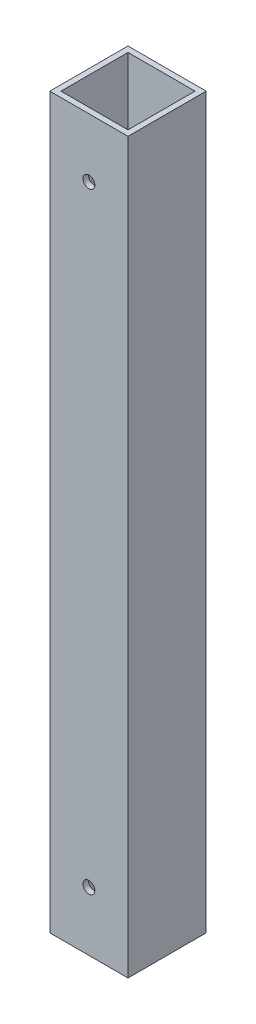
ISO-10303-21;
HEADER;
FILE_DESCRIPTION(('STEP AP214'),'2;1');
FILE_NAME('part.step','',(''),(''),'','','');
FILE_SCHEMA(('AUTOMOTIVE_DESIGN { 1 0 10303 214 1 1 1 1 }'));
ENDSEC;
DATA;
#1=APPLICATION_CONTEXT('core data for automotive mechanical design processes');
#2=APPLICATION_PROTOCOL_DEFINITION('international standard','automotive_design',2000,#1);
#3=PRODUCT_CONTEXT('',#1,'mechanical');
#4=PRODUCT('Part','Part','',(#3));
#5=PRODUCT_RELATED_PRODUCT_CATEGORY('part','',(#4));
#6=PRODUCT_DEFINITION_FORMATION('','',#4);
#7=PRODUCT_DEFINITION_CONTEXT('part definition',#1,'design');
#8=PRODUCT_DEFINITION('design','',#6,#7);
#9=PRODUCT_DEFINITION_SHAPE('','',#8);
#10=(LENGTH_UNIT() NAMED_UNIT(*) SI_UNIT(.MILLI.,.METRE.));
#11=(NAMED_UNIT(*) PLANE_ANGLE_UNIT() SI_UNIT($,.RADIAN.));
#12=(NAMED_UNIT(*) SI_UNIT($,.STERADIAN.) SOLID_ANGLE_UNIT());
#13=UNCERTAINTY_MEASURE_WITH_UNIT(LENGTH_MEASURE(1.E-05),#10,'distance_accuracy_value','');
#14=(GEOMETRIC_REPRESENTATION_CONTEXT(3) GLOBAL_UNCERTAINTY_ASSIGNED_CONTEXT((#13)) GLOBAL_UNIT_ASSIGNED_CONTEXT((#10,
#11,#12)) REPRESENTATION_CONTEXT('',''));
#15=CARTESIAN_POINT('',(0.,0.,0.));
#16=DIRECTION('',(0.,0.,1.));
#17=DIRECTION('',(1.,0.,0.));
#18=AXIS2_PLACEMENT_3D('',#15,#16,#17);
#19=CARTESIAN_POINT('',(22.2250000000001,-207.16875,22.225));
#20=DIRECTION('',(1.,0.,0.));
#21=DIRECTION('',(0.,0.,-1.));
#22=AXIS2_PLACEMENT_3D('',#19,#20,#21);
#23=PLANE('',#22);
#24=DIRECTION('',(0.,1.,0.));
#25=VECTOR('',#24,1.);
#26=CARTESIAN_POINT('',(22.2250000000001,-207.16875,-22.225));
#27=LINE('',#26,#25);
#28=CARTESIAN_POINT('',(22.2250000000001,-207.16875,-22.225));
#29=VERTEX_POINT('',#28);
#30=CARTESIAN_POINT('',(22.2250000000001,207.16875,-22.225));
#31=VERTEX_POINT('',#30);
#32=EDGE_CURVE('E191',#29,#31,#27,.T.);
#33=ORIENTED_EDGE('',*,*,#32,.T.);
#34=DIRECTION('',(0.,0.,-1.));
#35=VECTOR('',#34,1.);
#36=CARTESIAN_POINT('',(22.2250000000001,207.16875,22.225));
#37=LINE('',#36,#35);
#38=CARTESIAN_POINT('',(22.2250000000001,207.16875,22.225));
#39=VERTEX_POINT('',#38);
#40=EDGE_CURVE('E144',#39,#31,#37,.T.);
#41=ORIENTED_EDGE('',*,*,#40,.F.);
#42=DIRECTION('',(0.,1.,0.));
#43=VECTOR('',#42,1.);
#44=CARTESIAN_POINT('',(22.2250000000001,-207.16875,22.225));
#45=LINE('',#44,#43);
#46=CARTESIAN_POINT('',(22.2250000000001,-207.16875,22.225));
#47=VERTEX_POINT('',#46);
#48=EDGE_CURVE('E11',#47,#39,#45,.T.);
#49=ORIENTED_EDGE('',*,*,#48,.F.);
#50=DIRECTION('',(0.,0.,-1.));
#51=VECTOR('',#50,1.);
#52=CARTESIAN_POINT('',(22.2250000000001,-207.16875,22.225));
#53=LINE('',#52,#51);
#54=EDGE_CURVE('E172',#47,#29,#53,.T.);
#55=ORIENTED_EDGE('',*,*,#54,.T.);
#56=EDGE_LOOP('',(#33,#41,#49,#55));
#57=FACE_BOUND('',#56,.T.);
#58=ADVANCED_FACE('F40',(#57),#23,.T.);
#59=CARTESIAN_POINT('',(-22.2249999999999,-207.16875,22.225));
#60=DIRECTION('',(0.,0.,1.));
#61=DIRECTION('',(1.,0.,0.));
#62=AXIS2_PLACEMENT_3D('',#59,#60,#61);
#63=PLANE('',#62);
#64=CARTESIAN_POINT('',(0.,173.609,22.225));
#65=DIRECTION('',(0.,0.,1.));
#66=DIRECTION('',(1.,0.,0.));
#67=AXIS2_PLACEMENT_3D('',#64,#65,#66);
#68=CIRCLE('',#67,3.37350099999999);
#69=CARTESIAN_POINT('',(3.37350099999999,173.609,22.225));
#70=VERTEX_POINT('',#69);
#71=EDGE_CURVE('E227',#70,#70,#68,.T.);
#72=ORIENTED_EDGE('',*,*,#71,.F.);
#73=EDGE_LOOP('',(#72));
#74=FACE_BOUND('',#73,.T.);
#75=CARTESIAN_POINT('',(0.,-173.609,22.225));
#76=DIRECTION('',(0.,0.,1.));
#77=DIRECTION('',(1.,0.,0.));
#78=AXIS2_PLACEMENT_3D('',#75,#76,#77);
#79=CIRCLE('',#78,3.37350099999999);
#80=CARTESIAN_POINT('',(3.37350099999999,-173.609,22.225));
#81=VERTEX_POINT('',#80);
#82=EDGE_CURVE('E210',#81,#81,#79,.T.);
#83=ORIENTED_EDGE('',*,*,#82,.F.);
#84=EDGE_LOOP('',(#83));
#85=FACE_BOUND('',#84,.T.);
#86=ORIENTED_EDGE('',*,*,#48,.T.);
#87=DIRECTION('',(1.,0.,0.));
#88=VECTOR('',#87,1.);
#89=CARTESIAN_POINT('',(-22.2249999999999,207.16875,22.225));
#90=LINE('',#89,#88);
#91=CARTESIAN_POINT('',(-22.2249999999999,207.16875,22.225));
#92=VERTEX_POINT('',#91);
#93=EDGE_CURVE('E156',#92,#39,#90,.T.);
#94=ORIENTED_EDGE('',*,*,#93,.F.);
#95=DIRECTION('',(0.,1.,0.));
#96=VECTOR('',#95,1.);
#97=CARTESIAN_POINT('',(-22.2249999999999,-207.16875,22.225));
#98=LINE('',#97,#96);
#99=CARTESIAN_POINT('',(-22.2249999999999,-207.16875,22.225));
#100=VERTEX_POINT('',#99);
#101=EDGE_CURVE('E49',#100,#92,#98,.T.);
#102=ORIENTED_EDGE('',*,*,#101,.F.);
#103=DIRECTION('',(1.,0.,0.));
#104=VECTOR('',#103,1.);
#105=CARTESIAN_POINT('',(-22.2249999999999,-207.16875,22.225));
#106=LINE('',#105,#104);
#107=EDGE_CURVE('E188',#100,#47,#106,.T.);
#108=ORIENTED_EDGE('',*,*,#107,.T.);
#109=EDGE_LOOP('',(#86,#94,#102,#108));
#110=FACE_BOUND('',#109,.T.);
#111=ADVANCED_FACE('F236',(#74,#85,#110),#63,.T.);
#112=CARTESIAN_POINT('',(-22.2249999999999,-207.16875,22.225));
#113=DIRECTION('',(-1.,0.,0.));
#114=DIRECTION('',(0.,0.,1.));
#115=AXIS2_PLACEMENT_3D('',#112,#113,#114);
#116=PLANE('',#115);
#117=ORIENTED_EDGE('',*,*,#101,.T.);
#118=DIRECTION('',(0.,0.,1.));
#119=VECTOR('',#118,1.);
#120=CARTESIAN_POINT('',(-22.2249999999999,207.16875,22.225));
#121=LINE('',#120,#119);
#122=CARTESIAN_POINT('',(-22.2249999999999,207.16875,-22.225));
#123=VERTEX_POINT('',#122);
#124=EDGE_CURVE('E152',#123,#92,#121,.T.);
#125=ORIENTED_EDGE('',*,*,#124,.F.);
#126=DIRECTION('',(0.,1.,0.));
#127=VECTOR('',#126,1.);
#128=CARTESIAN_POINT('',(-22.2249999999999,-207.16875,-22.225));
#129=LINE('',#128,#127);
#130=CARTESIAN_POINT('',(-22.2249999999999,-207.16875,-22.225));
#131=VERTEX_POINT('',#130);
#132=EDGE_CURVE('E195',#131,#123,#129,.T.);
#133=ORIENTED_EDGE('',*,*,#132,.F.);
#134=DIRECTION('',(0.,0.,1.));
#135=VECTOR('',#134,1.);
#136=CARTESIAN_POINT('',(-22.2249999999999,-207.16875,22.225));
#137=LINE('',#136,#135);
#138=EDGE_CURVE('E184',#131,#100,#137,.T.);
#139=ORIENTED_EDGE('',*,*,#138,.T.);
#140=EDGE_LOOP('',(#117,#125,#133,#139));
#141=FACE_BOUND('',#140,.T.);
#142=ADVANCED_FACE('F239',(#141),#116,.T.);
#143=CARTESIAN_POINT('',(-22.2249999999999,-207.16875,-22.225));
#144=DIRECTION('',(0.,0.,-1.));
#145=DIRECTION('',(-1.,0.,0.));
#146=AXIS2_PLACEMENT_3D('',#143,#144,#145);
#147=PLANE('',#146);
#148=CARTESIAN_POINT('',(0.,173.609,-22.225));
#149=DIRECTION('',(0.,0.,1.));
#150=DIRECTION('',(1.,0.,0.));
#151=AXIS2_PLACEMENT_3D('',#148,#149,#150);
#152=CIRCLE('',#151,3.37350099999999);
#153=CARTESIAN_POINT('',(3.37350099999999,173.609,-22.225));
#154=VERTEX_POINT('',#153);
#155=EDGE_CURVE('E223',#154,#154,#152,.T.);
#156=ORIENTED_EDGE('',*,*,#155,.T.);
#157=EDGE_LOOP('',(#156));
#158=FACE_BOUND('',#157,.T.);
#159=CARTESIAN_POINT('',(0.,-173.609,-22.225));
#160=DIRECTION('',(0.,0.,1.));
#161=DIRECTION('',(1.,0.,0.));
#162=AXIS2_PLACEMENT_3D('',#159,#160,#161);
#163=CIRCLE('',#162,3.37350099999999);
#164=CARTESIAN_POINT('',(3.37350099999999,-173.609,-22.225));
#165=VERTEX_POINT('',#164);
#166=EDGE_CURVE('E202',#165,#165,#163,.T.);
#167=ORIENTED_EDGE('',*,*,#166,.T.);
#168=EDGE_LOOP('',(#167));
#169=FACE_BOUND('',#168,.T.);
#170=ORIENTED_EDGE('',*,*,#132,.T.);
#171=DIRECTION('',(-1.,0.,0.));
#172=VECTOR('',#171,1.);
#173=CARTESIAN_POINT('',(-22.2249999999999,207.16875,-22.225));
#174=LINE('',#173,#172);
#175=EDGE_CURVE('E148',#31,#123,#174,.T.);
#176=ORIENTED_EDGE('',*,*,#175,.F.);
#177=ORIENTED_EDGE('',*,*,#32,.F.);
#178=DIRECTION('',(-1.,0.,0.));
#179=VECTOR('',#178,1.);
#180=CARTESIAN_POINT('',(-22.2249999999999,-207.16875,-22.225));
#181=LINE('',#180,#179);
#182=EDGE_CURVE('E180',#29,#131,#181,.T.);
#183=ORIENTED_EDGE('',*,*,#182,.T.);
#184=EDGE_LOOP('',(#170,#176,#177,#183));
#185=FACE_BOUND('',#184,.T.);
#186=ADVANCED_FACE('F250',(#158,#169,#185),#147,.T.);
#187=CARTESIAN_POINT('',(0.,-207.16875,0.));
#188=DIRECTION('',(0.,-1.,0.));
#189=DIRECTION('',(0.,0.,-1.));
#190=AXIS2_PLACEMENT_3D('',#187,#188,#189);
#191=PLANE('',#190);
#192=DIRECTION('',(0.,0.,-1.));
#193=VECTOR('',#192,1.);
#194=CARTESIAN_POINT('',(19.05,-207.16875,19.05));
#195=LINE('',#194,#193);
#196=CARTESIAN_POINT('',(19.05,-207.16875,19.05));
#197=VERTEX_POINT('',#196);
#198=CARTESIAN_POINT('',(19.05,-207.16875,-19.05));
#199=VERTEX_POINT('',#198);
#200=EDGE_CURVE('E160',#197,#199,#195,.T.);
#201=ORIENTED_EDGE('',*,*,#200,.T.);
#202=DIRECTION('',(-1.,0.,0.));
#203=VECTOR('',#202,1.);
#204=CARTESIAN_POINT('',(-19.05,-207.16875,-19.05));
#205=LINE('',#204,#203);
#206=CARTESIAN_POINT('',(-19.05,-207.16875,-19.05));
#207=VERTEX_POINT('',#206);
#208=EDGE_CURVE('E113',#199,#207,#205,.T.);
#209=ORIENTED_EDGE('',*,*,#208,.T.);
#210=DIRECTION('',(0.,0.,1.));
#211=VECTOR('',#210,1.);
#212=CARTESIAN_POINT('',(-19.05,-207.16875,19.05));
#213=LINE('',#212,#211);
#214=CARTESIAN_POINT('',(-19.05,-207.16875,19.05));
#215=VERTEX_POINT('',#214);
#216=EDGE_CURVE('E57',#207,#215,#213,.T.);
#217=ORIENTED_EDGE('',*,*,#216,.T.);
#218=DIRECTION('',(1.,0.,0.));
#219=VECTOR('',#218,1.);
#220=CARTESIAN_POINT('',(-19.05,-207.16875,19.05));
#221=LINE('',#220,#219);
#222=EDGE_CURVE('E119',#215,#197,#221,.T.);
#223=ORIENTED_EDGE('',*,*,#222,.T.);
#224=EDGE_LOOP('',(#201,#209,#217,#223));
#225=FACE_BOUND('',#224,.T.);
#226=ORIENTED_EDGE('',*,*,#54,.F.);
#227=ORIENTED_EDGE('',*,*,#107,.F.);
#228=ORIENTED_EDGE('',*,*,#138,.F.);
#229=ORIENTED_EDGE('',*,*,#182,.F.);
#230=EDGE_LOOP('',(#226,#227,#228,#229));
#231=FACE_BOUND('',#230,.T.);
#232=ADVANCED_FACE('F254',(#225,#231),#191,.T.);
#233=CARTESIAN_POINT('',(19.05,-207.16875,19.05));
#234=DIRECTION('',(1.,0.,0.));
#235=DIRECTION('',(0.,0.,-1.));
#236=AXIS2_PLACEMENT_3D('',#233,#234,#235);
#237=PLANE('',#236);
#238=DIRECTION('',(0.,1.,0.));
#239=VECTOR('',#238,1.);
#240=CARTESIAN_POINT('',(19.05,-207.16875,19.05));
#241=LINE('',#240,#239);
#242=CARTESIAN_POINT('',(19.05,207.16875,19.05));
#243=VERTEX_POINT('',#242);
#244=EDGE_CURVE('E124',#197,#243,#241,.T.);
#245=ORIENTED_EDGE('',*,*,#244,.T.);
#246=DIRECTION('',(0.,0.,-1.));
#247=VECTOR('',#246,1.);
#248=CARTESIAN_POINT('',(19.05,207.16875,19.05));
#249=LINE('',#248,#247);
#250=CARTESIAN_POINT('',(19.05,207.16875,-19.05));
#251=VERTEX_POINT('',#250);
#252=EDGE_CURVE('E122',#243,#251,#249,.T.);
#253=ORIENTED_EDGE('',*,*,#252,.T.);
#254=DIRECTION('',(0.,1.,0.));
#255=VECTOR('',#254,1.);
#256=CARTESIAN_POINT('',(19.05,-207.16875,-19.05));
#257=LINE('',#256,#255);
#258=EDGE_CURVE('E106',#199,#251,#257,.T.);
#259=ORIENTED_EDGE('',*,*,#258,.F.);
#260=ORIENTED_EDGE('',*,*,#200,.F.);
#261=EDGE_LOOP('',(#245,#253,#259,#260));
#262=FACE_BOUND('',#261,.T.);
#263=ADVANCED_FACE('F123',(#262),#237,.F.);
#264=CARTESIAN_POINT('',(-19.05,-207.16875,19.05));
#265=DIRECTION('',(0.,0.,1.));
#266=DIRECTION('',(1.,0.,0.));
#267=AXIS2_PLACEMENT_3D('',#264,#265,#266);
#268=PLANE('',#267);
#269=CARTESIAN_POINT('',(0.,173.609,19.05));
#270=DIRECTION('',(0.,0.,1.));
#271=DIRECTION('',(1.,0.,0.));
#272=AXIS2_PLACEMENT_3D('',#269,#270,#271);
#273=CIRCLE('',#272,3.37350099999999);
#274=CARTESIAN_POINT('',(3.37350099999999,173.609,19.05));
#275=VERTEX_POINT('',#274);
#276=EDGE_CURVE('E217',#275,#275,#273,.T.);
#277=ORIENTED_EDGE('',*,*,#276,.T.);
#278=EDGE_LOOP('',(#277));
#279=FACE_BOUND('',#278,.T.);
#280=CARTESIAN_POINT('',(0.,-173.609,19.05));
#281=DIRECTION('',(0.,0.,1.));
#282=DIRECTION('',(1.,0.,0.));
#283=AXIS2_PLACEMENT_3D('',#280,#281,#282);
#284=CIRCLE('',#283,3.37350099999999);
#285=CARTESIAN_POINT('',(3.37350099999999,-173.609,19.05));
#286=VERTEX_POINT('',#285);
#287=EDGE_CURVE('E129',#286,#286,#284,.T.);
#288=ORIENTED_EDGE('',*,*,#287,.T.);
#289=EDGE_LOOP('',(#288));
#290=FACE_BOUND('',#289,.T.);
#291=DIRECTION('',(0.,1.,0.));
#292=VECTOR('',#291,1.);
#293=CARTESIAN_POINT('',(-19.05,-207.16875,19.05));
#294=LINE('',#293,#292);
#295=CARTESIAN_POINT('',(-19.05,207.16875,19.05));
#296=VERTEX_POINT('',#295);
#297=EDGE_CURVE('E173',#215,#296,#294,.T.);
#298=ORIENTED_EDGE('',*,*,#297,.T.);
#299=DIRECTION('',(1.,0.,0.));
#300=VECTOR('',#299,1.);
#301=CARTESIAN_POINT('',(-19.05,207.16875,19.05));
#302=LINE('',#301,#300);
#303=EDGE_CURVE('E138',#296,#243,#302,.T.);
#304=ORIENTED_EDGE('',*,*,#303,.T.);
#305=ORIENTED_EDGE('',*,*,#244,.F.);
#306=ORIENTED_EDGE('',*,*,#222,.F.);
#307=EDGE_LOOP('',(#298,#304,#305,#306));
#308=FACE_BOUND('',#307,.T.);
#309=ADVANCED_FACE('F262',(#279,#290,#308),#268,.F.);
#310=CARTESIAN_POINT('',(-19.05,-207.16875,19.05));
#311=DIRECTION('',(-1.,0.,0.));
#312=DIRECTION('',(0.,0.,1.));
#313=AXIS2_PLACEMENT_3D('',#310,#311,#312);
#314=PLANE('',#313);
#315=DIRECTION('',(0.,1.,0.));
#316=VECTOR('',#315,1.);
#317=CARTESIAN_POINT('',(-19.05,-207.16875,-19.05));
#318=LINE('',#317,#316);
#319=CARTESIAN_POINT('',(-19.05,207.16875,-19.05));
#320=VERTEX_POINT('',#319);
#321=EDGE_CURVE('E118',#207,#320,#318,.T.);
#322=ORIENTED_EDGE('',*,*,#321,.T.);
#323=DIRECTION('',(0.,0.,1.));
#324=VECTOR('',#323,1.);
#325=CARTESIAN_POINT('',(-19.05,207.16875,19.05));
#326=LINE('',#325,#324);
#327=EDGE_CURVE('E133',#320,#296,#326,.T.);
#328=ORIENTED_EDGE('',*,*,#327,.T.);
#329=ORIENTED_EDGE('',*,*,#297,.F.);
#330=ORIENTED_EDGE('',*,*,#216,.F.);
#331=EDGE_LOOP('',(#322,#328,#329,#330));
#332=FACE_BOUND('',#331,.T.);
#333=ADVANCED_FACE('F301',(#332),#314,.F.);
#334=CARTESIAN_POINT('',(-19.05,-207.16875,-19.05));
#335=DIRECTION('',(0.,0.,-1.));
#336=DIRECTION('',(-1.,0.,0.));
#337=AXIS2_PLACEMENT_3D('',#334,#335,#336);
#338=PLANE('',#337);
#339=CARTESIAN_POINT('',(0.,173.609,-19.05));
#340=DIRECTION('',(0.,0.,-1.));
#341=DIRECTION('',(-1.,0.,0.));
#342=AXIS2_PLACEMENT_3D('',#339,#340,#341);
#343=CIRCLE('',#342,3.37350099999999);
#344=CARTESIAN_POINT('',(-3.37350099999999,173.609,-19.05));
#345=VERTEX_POINT('',#344);
#346=EDGE_CURVE('E43',#345,#345,#343,.T.);
#347=ORIENTED_EDGE('',*,*,#346,.T.);
#348=EDGE_LOOP('',(#347));
#349=FACE_BOUND('',#348,.T.);
#350=CARTESIAN_POINT('',(0.,-173.609,-19.05));
#351=DIRECTION('',(0.,0.,-1.));
#352=DIRECTION('',(-1.,0.,0.));
#353=AXIS2_PLACEMENT_3D('',#350,#351,#352);
#354=CIRCLE('',#353,3.37350099999999);
#355=CARTESIAN_POINT('',(-3.37350099999999,-173.609,-19.05));
#356=VERTEX_POINT('',#355);
#357=EDGE_CURVE('E199',#356,#356,#354,.T.);
#358=ORIENTED_EDGE('',*,*,#357,.T.);
#359=EDGE_LOOP('',(#358));
#360=FACE_BOUND('',#359,.T.);
#361=ORIENTED_EDGE('',*,*,#258,.T.);
#362=DIRECTION('',(-1.,0.,0.));
#363=VECTOR('',#362,1.);
#364=CARTESIAN_POINT('',(-19.05,207.16875,-19.05));
#365=LINE('',#364,#363);
#366=EDGE_CURVE('E110',#251,#320,#365,.T.);
#367=ORIENTED_EDGE('',*,*,#366,.T.);
#368=ORIENTED_EDGE('',*,*,#321,.F.);
#369=ORIENTED_EDGE('',*,*,#208,.F.);
#370=EDGE_LOOP('',(#361,#367,#368,#369));
#371=FACE_BOUND('',#370,.T.);
#372=ADVANCED_FACE('F108',(#349,#360,#371),#338,.F.);
#373=CARTESIAN_POINT('',(0.,207.16875,0.));
#374=DIRECTION('',(0.,-1.,0.));
#375=DIRECTION('',(0.,0.,-1.));
#376=AXIS2_PLACEMENT_3D('',#373,#374,#375);
#377=PLANE('',#376);
#378=ORIENTED_EDGE('',*,*,#40,.T.);
#379=ORIENTED_EDGE('',*,*,#175,.T.);
#380=ORIENTED_EDGE('',*,*,#124,.T.);
#381=ORIENTED_EDGE('',*,*,#93,.T.);
#382=EDGE_LOOP('',(#378,#379,#380,#381));
#383=FACE_BOUND('',#382,.T.);
#384=ORIENTED_EDGE('',*,*,#252,.F.);
#385=ORIENTED_EDGE('',*,*,#303,.F.);
#386=ORIENTED_EDGE('',*,*,#327,.F.);
#387=ORIENTED_EDGE('',*,*,#366,.F.);
#388=EDGE_LOOP('',(#384,#385,#386,#387));
#389=FACE_BOUND('',#388,.T.);
#390=ADVANCED_FACE('F131',(#383,#389),#377,.F.);
#391=CARTESIAN_POINT('',(0.,-173.609,22.225));
#392=DIRECTION('',(0.,0.,1.));
#393=DIRECTION('',(1.,0.,0.));
#394=AXIS2_PLACEMENT_3D('',#391,#392,#393);
#395=CYLINDRICAL_SURFACE('',#394,3.37350099999999);
#396=ORIENTED_EDGE('',*,*,#166,.F.);
#397=EDGE_LOOP('',(#396));
#398=FACE_BOUND('',#397,.T.);
#399=ORIENTED_EDGE('',*,*,#357,.F.);
#400=EDGE_LOOP('',(#399));
#401=FACE_BOUND('',#400,.T.);
#402=ADVANCED_FACE('F328',(#398,#401),#395,.F.);
#403=ORIENTED_EDGE('',*,*,#82,.T.);
#404=EDGE_LOOP('',(#403));
#405=FACE_BOUND('',#404,.T.);
#406=ORIENTED_EDGE('',*,*,#287,.F.);
#407=EDGE_LOOP('',(#406));
#408=FACE_BOUND('',#407,.T.);
#409=ADVANCED_FACE('F337',(#405,#408),#395,.F.);
#410=CARTESIAN_POINT('',(0.,173.609,22.225));
#411=DIRECTION('',(0.,0.,1.));
#412=DIRECTION('',(1.,0.,0.));
#413=AXIS2_PLACEMENT_3D('',#410,#411,#412);
#414=CYLINDRICAL_SURFACE('',#413,3.37350099999999);
#415=ORIENTED_EDGE('',*,*,#155,.F.);
#416=EDGE_LOOP('',(#415));
#417=FACE_BOUND('',#416,.T.);
#418=ORIENTED_EDGE('',*,*,#346,.F.);
#419=EDGE_LOOP('',(#418));
#420=FACE_BOUND('',#419,.T.);
#421=ADVANCED_FACE('F347',(#417,#420),#414,.F.);
#422=ORIENTED_EDGE('',*,*,#71,.T.);
#423=EDGE_LOOP('',(#422));
#424=FACE_BOUND('',#423,.T.);
#425=ORIENTED_EDGE('',*,*,#276,.F.);
#426=EDGE_LOOP('',(#425));
#427=FACE_BOUND('',#426,.T.);
#428=ADVANCED_FACE('F233',(#424,#427),#414,.F.);
#429=CLOSED_SHELL('',(#58,#111,#142,#186,#232,#263,#309,#333,#372,#390,#402,#409,#421,#428));
#430=MANIFOLD_SOLID_BREP('B2',#429);
#431=ADVANCED_BREP_SHAPE_REPRESENTATION('',(#18,#430),#14);
#432=SHAPE_DEFINITION_REPRESENTATION(#9,#431);
ENDSEC;
END-ISO-10303-21;
